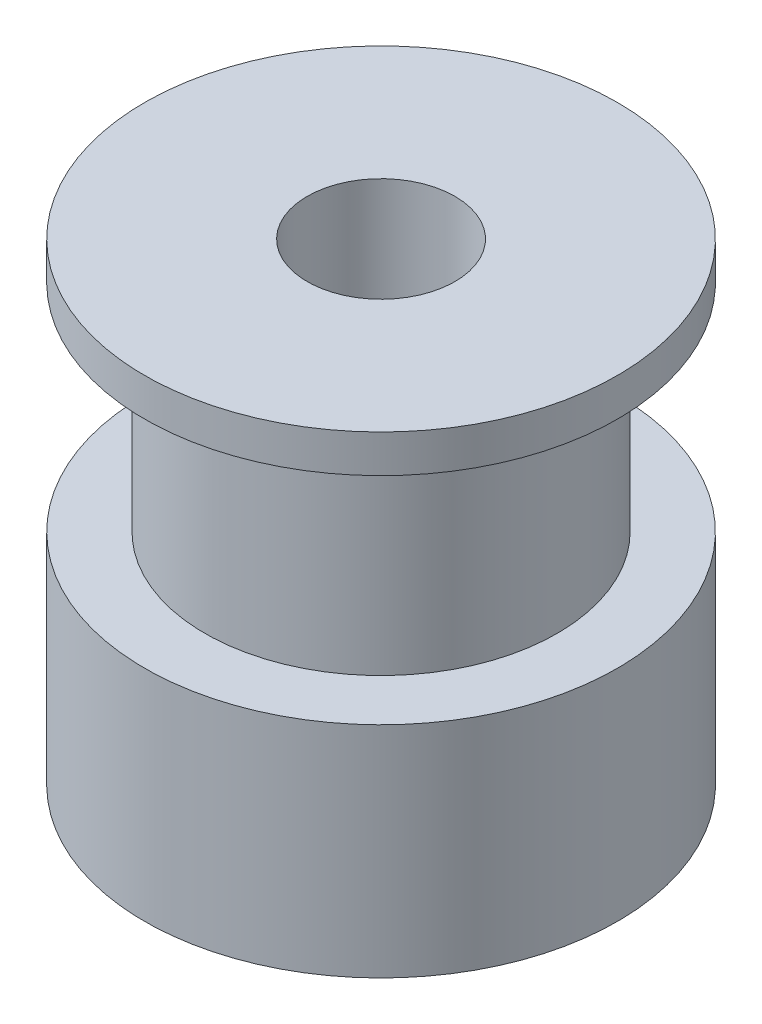
ISO-10303-21;
HEADER;
FILE_DESCRIPTION(('STEP AP214'),'2;1');
FILE_NAME('part.step','',(''),(''),'','','');
FILE_SCHEMA(('AUTOMOTIVE_DESIGN { 1 0 10303 214 1 1 1 1 }'));
ENDSEC;
DATA;
#1=APPLICATION_CONTEXT('core data for automotive mechanical design processes');
#2=APPLICATION_PROTOCOL_DEFINITION('international standard','automotive_design',2000,#1);
#3=PRODUCT_CONTEXT('',#1,'mechanical');
#4=PRODUCT('Part','Part','',(#3));
#5=PRODUCT_RELATED_PRODUCT_CATEGORY('part','',(#4));
#6=PRODUCT_DEFINITION_FORMATION('','',#4);
#7=PRODUCT_DEFINITION_CONTEXT('part definition',#1,'design');
#8=PRODUCT_DEFINITION('design','',#6,#7);
#9=PRODUCT_DEFINITION_SHAPE('','',#8);
#10=(LENGTH_UNIT() NAMED_UNIT(*) SI_UNIT(.MILLI.,.METRE.));
#11=(NAMED_UNIT(*) PLANE_ANGLE_UNIT() SI_UNIT($,.RADIAN.));
#12=(NAMED_UNIT(*) SI_UNIT($,.STERADIAN.) SOLID_ANGLE_UNIT());
#13=UNCERTAINTY_MEASURE_WITH_UNIT(LENGTH_MEASURE(1.E-05),#10,'distance_accuracy_value','');
#14=(GEOMETRIC_REPRESENTATION_CONTEXT(3) GLOBAL_UNCERTAINTY_ASSIGNED_CONTEXT((#13)) GLOBAL_UNIT_ASSIGNED_CONTEXT((#10,
#11,#12)) REPRESENTATION_CONTEXT('',''));
#15=CARTESIAN_POINT('',(0.,0.,0.));
#16=DIRECTION('',(0.,0.,1.));
#17=DIRECTION('',(1.,0.,0.));
#18=AXIS2_PLACEMENT_3D('',#15,#16,#17);
#19=CARTESIAN_POINT('',(8.,0.,0.));
#20=DIRECTION('',(0.,-1.,0.));
#21=DIRECTION('',(0.,0.,-1.));
#22=AXIS2_PLACEMENT_3D('',#19,#20,#21);
#23=PLANE('',#22);
#24=CARTESIAN_POINT('',(0.,0.,0.));
#25=DIRECTION('',(0.,-1.,0.));
#26=DIRECTION('',(0.,0.,-1.));
#27=AXIS2_PLACEMENT_3D('',#24,#25,#26);
#28=CIRCLE('',#27,8.);
#29=CARTESIAN_POINT('',(0.,0.,-8.));
#30=VERTEX_POINT('',#29);
#31=EDGE_CURVE('E71',#30,#30,#28,.T.);
#32=ORIENTED_EDGE('',*,*,#31,.T.);
#33=EDGE_LOOP('',(#32));
#34=FACE_BOUND('',#33,.T.);
#35=CARTESIAN_POINT('',(0.,0.,0.));
#36=DIRECTION('',(0.,-1.,0.));
#37=DIRECTION('',(0.,0.,-1.));
#38=AXIS2_PLACEMENT_3D('',#35,#36,#37);
#39=CIRCLE('',#38,2.5);
#40=CARTESIAN_POINT('',(0.,0.,-2.5));
#41=VERTEX_POINT('',#40);
#42=EDGE_CURVE('E10',#41,#41,#39,.T.);
#43=ORIENTED_EDGE('',*,*,#42,.F.);
#44=EDGE_LOOP('',(#43));
#45=FACE_BOUND('',#44,.T.);
#46=ADVANCED_FACE('F35',(#34,#45),#23,.T.);
#47=CARTESIAN_POINT('',(0.,0.,0.));
#48=DIRECTION('',(0.,-1.,0.));
#49=DIRECTION('',(0.,0.,-1.));
#50=AXIS2_PLACEMENT_3D('',#47,#48,#49);
#51=CYLINDRICAL_SURFACE('',#50,2.5);
#52=ORIENTED_EDGE('',*,*,#42,.T.);
#53=EDGE_LOOP('',(#52));
#54=FACE_BOUND('',#53,.T.);
#55=CARTESIAN_POINT('',(0.,16.,0.));
#56=DIRECTION('',(0.,-1.,0.));
#57=DIRECTION('',(0.,0.,-1.));
#58=AXIS2_PLACEMENT_3D('',#55,#56,#57);
#59=CIRCLE('',#58,2.5);
#60=CARTESIAN_POINT('',(0.,16.,-2.5));
#61=VERTEX_POINT('',#60);
#62=EDGE_CURVE('E42',#61,#61,#59,.T.);
#63=ORIENTED_EDGE('',*,*,#62,.F.);
#64=EDGE_LOOP('',(#63));
#65=FACE_BOUND('',#64,.T.);
#66=ADVANCED_FACE('F89',(#54,#65),#51,.F.);
#67=CARTESIAN_POINT('',(2.5,16.,0.));
#68=DIRECTION('',(0.,1.,0.));
#69=DIRECTION('',(0.,0.,1.));
#70=AXIS2_PLACEMENT_3D('',#67,#68,#69);
#71=PLANE('',#70);
#72=ORIENTED_EDGE('',*,*,#62,.T.);
#73=EDGE_LOOP('',(#72));
#74=FACE_BOUND('',#73,.T.);
#75=CARTESIAN_POINT('',(0.,16.,0.));
#76=DIRECTION('',(0.,-1.,0.));
#77=DIRECTION('',(0.,0.,-1.));
#78=AXIS2_PLACEMENT_3D('',#75,#76,#77);
#79=CIRCLE('',#78,8.);
#80=CARTESIAN_POINT('',(0.,16.,-8.));
#81=VERTEX_POINT('',#80);
#82=EDGE_CURVE('E48',#81,#81,#79,.T.);
#83=ORIENTED_EDGE('',*,*,#82,.F.);
#84=EDGE_LOOP('',(#83));
#85=FACE_BOUND('',#84,.T.);
#86=ADVANCED_FACE('F93',(#74,#85),#71,.T.);
#87=CARTESIAN_POINT('',(0.,0.,0.));
#88=DIRECTION('',(0.,-1.,0.));
#89=DIRECTION('',(0.,0.,-1.));
#90=AXIS2_PLACEMENT_3D('',#87,#88,#89);
#91=CYLINDRICAL_SURFACE('',#90,8.);
#92=ORIENTED_EDGE('',*,*,#82,.T.);
#93=EDGE_LOOP('',(#92));
#94=FACE_BOUND('',#93,.T.);
#95=CARTESIAN_POINT('',(0.,14.72,0.));
#96=DIRECTION('',(0.,-1.,0.));
#97=DIRECTION('',(0.,0.,-1.));
#98=AXIS2_PLACEMENT_3D('',#95,#96,#97);
#99=CIRCLE('',#98,8.);
#100=CARTESIAN_POINT('',(0.,14.72,-8.));
#101=VERTEX_POINT('',#100);
#102=EDGE_CURVE('E53',#101,#101,#99,.T.);
#103=ORIENTED_EDGE('',*,*,#102,.F.);
#104=EDGE_LOOP('',(#103));
#105=FACE_BOUND('',#104,.T.);
#106=ADVANCED_FACE('F97',(#94,#105),#91,.T.);
#107=CARTESIAN_POINT('',(8.,14.72,0.));
#108=DIRECTION('',(0.,-1.,0.));
#109=DIRECTION('',(0.,0.,-1.));
#110=AXIS2_PLACEMENT_3D('',#107,#108,#109);
#111=PLANE('',#110);
#112=ORIENTED_EDGE('',*,*,#102,.T.);
#113=EDGE_LOOP('',(#112));
#114=FACE_BOUND('',#113,.T.);
#115=CARTESIAN_POINT('',(0.,14.72,0.));
#116=DIRECTION('',(0.,-1.,0.));
#117=DIRECTION('',(0.,0.,-1.));
#118=AXIS2_PLACEMENT_3D('',#115,#116,#117);
#119=CIRCLE('',#118,5.96);
#120=CARTESIAN_POINT('',(0.,14.72,-5.96));
#121=VERTEX_POINT('',#120);
#122=EDGE_CURVE('E59',#121,#121,#119,.T.);
#123=ORIENTED_EDGE('',*,*,#122,.F.);
#124=EDGE_LOOP('',(#123));
#125=FACE_BOUND('',#124,.T.);
#126=ADVANCED_FACE('F103',(#114,#125),#111,.T.);
#127=CARTESIAN_POINT('',(0.,0.,0.));
#128=DIRECTION('',(0.,-1.,0.));
#129=DIRECTION('',(0.,0.,-1.));
#130=AXIS2_PLACEMENT_3D('',#127,#128,#129);
#131=CYLINDRICAL_SURFACE('',#130,5.96);
#132=ORIENTED_EDGE('',*,*,#122,.T.);
#133=EDGE_LOOP('',(#132));
#134=FACE_BOUND('',#133,.T.);
#135=CARTESIAN_POINT('',(0.,7.42,0.));
#136=DIRECTION('',(0.,-1.,0.));
#137=DIRECTION('',(0.,0.,-1.));
#138=AXIS2_PLACEMENT_3D('',#135,#136,#137);
#139=CIRCLE('',#138,5.96);
#140=CARTESIAN_POINT('',(0.,7.42,-5.96));
#141=VERTEX_POINT('',#140);
#142=EDGE_CURVE('E63',#141,#141,#139,.T.);
#143=ORIENTED_EDGE('',*,*,#142,.F.);
#144=EDGE_LOOP('',(#143));
#145=FACE_BOUND('',#144,.T.);
#146=ADVANCED_FACE('F85',(#134,#145),#131,.T.);
#147=CARTESIAN_POINT('',(5.96,7.42,0.));
#148=DIRECTION('',(0.,1.,0.));
#149=DIRECTION('',(0.,0.,1.));
#150=AXIS2_PLACEMENT_3D('',#147,#148,#149);
#151=PLANE('',#150);
#152=ORIENTED_EDGE('',*,*,#142,.T.);
#153=EDGE_LOOP('',(#152));
#154=FACE_BOUND('',#153,.T.);
#155=CARTESIAN_POINT('',(0.,7.42,0.));
#156=DIRECTION('',(0.,-1.,0.));
#157=DIRECTION('',(0.,0.,-1.));
#158=AXIS2_PLACEMENT_3D('',#155,#156,#157);
#159=CIRCLE('',#158,8.);
#160=CARTESIAN_POINT('',(0.,7.42,-8.));
#161=VERTEX_POINT('',#160);
#162=EDGE_CURVE('E67',#161,#161,#159,.T.);
#163=ORIENTED_EDGE('',*,*,#162,.F.);
#164=EDGE_LOOP('',(#163));
#165=FACE_BOUND('',#164,.T.);
#166=ADVANCED_FACE('F79',(#154,#165),#151,.T.);
#167=CARTESIAN_POINT('',(0.,0.,0.));
#168=DIRECTION('',(0.,-1.,0.));
#169=DIRECTION('',(0.,0.,-1.));
#170=AXIS2_PLACEMENT_3D('',#167,#168,#169);
#171=CYLINDRICAL_SURFACE('',#170,8.);
#172=ORIENTED_EDGE('',*,*,#162,.T.);
#173=EDGE_LOOP('',(#172));
#174=FACE_BOUND('',#173,.T.);
#175=ORIENTED_EDGE('',*,*,#31,.F.);
#176=EDGE_LOOP('',(#175));
#177=FACE_BOUND('',#176,.T.);
#178=ADVANCED_FACE('F77',(#174,#177),#171,.T.);
#179=CLOSED_SHELL('',(#46,#66,#86,#106,#126,#146,#166,#178));
#180=MANIFOLD_SOLID_BREP('B2',#179);
#181=ADVANCED_BREP_SHAPE_REPRESENTATION('',(#18,#180),#14);
#182=SHAPE_DEFINITION_REPRESENTATION(#9,#181);
ENDSEC;
END-ISO-10303-21;
